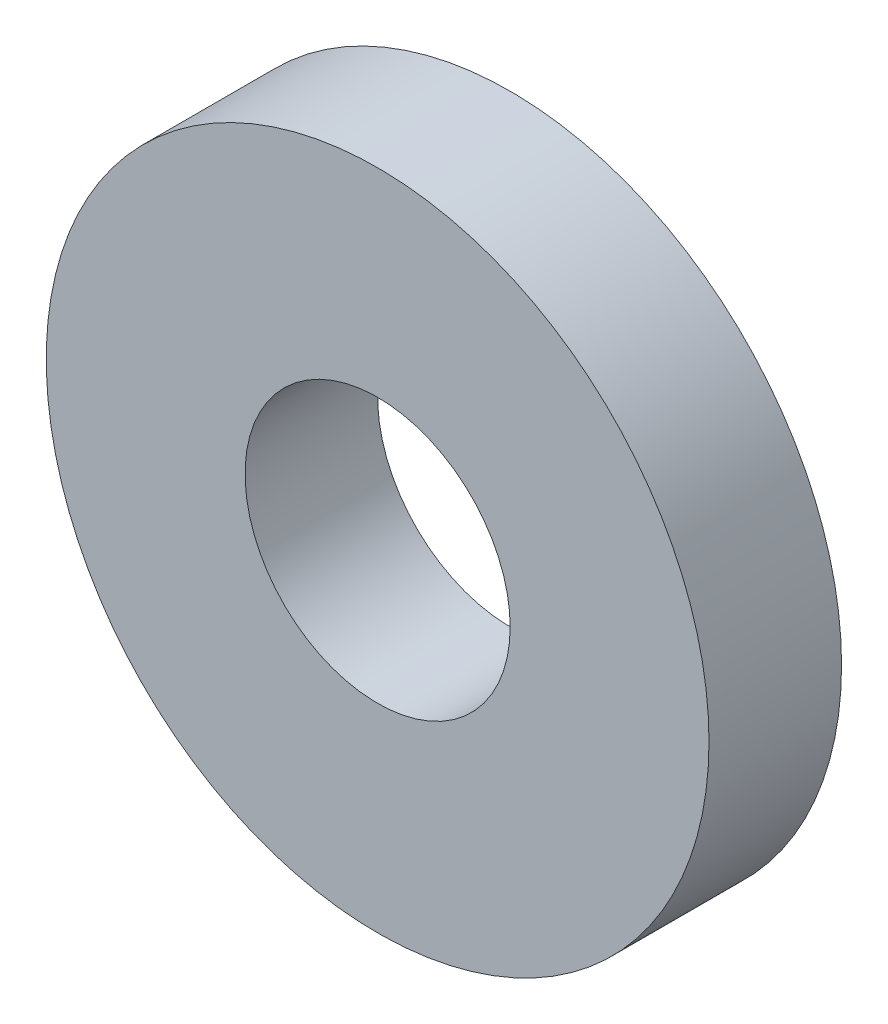
ISO-10303-21;
HEADER;
FILE_DESCRIPTION(('STEP AP214'),'2;1');
FILE_NAME('part.step','',(''),(''),'','','');
FILE_SCHEMA(('AUTOMOTIVE_DESIGN { 1 0 10303 214 1 1 1 1 }'));
ENDSEC;
DATA;
#1=APPLICATION_CONTEXT('core data for automotive mechanical design processes');
#2=APPLICATION_PROTOCOL_DEFINITION('international standard','automotive_design',2000,#1);
#3=PRODUCT_CONTEXT('',#1,'mechanical');
#4=PRODUCT('Part','Part','',(#3));
#5=PRODUCT_RELATED_PRODUCT_CATEGORY('part','',(#4));
#6=PRODUCT_DEFINITION_FORMATION('','',#4);
#7=PRODUCT_DEFINITION_CONTEXT('part definition',#1,'design');
#8=PRODUCT_DEFINITION('design','',#6,#7);
#9=PRODUCT_DEFINITION_SHAPE('','',#8);
#10=(LENGTH_UNIT() NAMED_UNIT(*) SI_UNIT(.MILLI.,.METRE.));
#11=(NAMED_UNIT(*) PLANE_ANGLE_UNIT() SI_UNIT($,.RADIAN.));
#12=(NAMED_UNIT(*) SI_UNIT($,.STERADIAN.) SOLID_ANGLE_UNIT());
#13=UNCERTAINTY_MEASURE_WITH_UNIT(LENGTH_MEASURE(1.E-05),#10,'distance_accuracy_value','');
#14=(GEOMETRIC_REPRESENTATION_CONTEXT(3) GLOBAL_UNCERTAINTY_ASSIGNED_CONTEXT((#13)) GLOBAL_UNIT_ASSIGNED_CONTEXT((#10,
#11,#12)) REPRESENTATION_CONTEXT('',''));
#15=CARTESIAN_POINT('',(0.,0.,0.));
#16=DIRECTION('',(0.,0.,1.));
#17=DIRECTION('',(1.,0.,0.));
#18=AXIS2_PLACEMENT_3D('',#15,#16,#17);
#19=CARTESIAN_POINT('',(0.,0.,2.54));
#20=DIRECTION('',(0.,0.,-1.));
#21=DIRECTION('',(-1.,0.,0.));
#22=AXIS2_PLACEMENT_3D('',#19,#20,#21);
#23=PLANE('',#22);
#24=CARTESIAN_POINT('',(0.,0.,2.54));
#25=DIRECTION('',(0.,0.,1.));
#26=DIRECTION('',(1.,0.,0.));
#27=AXIS2_PLACEMENT_3D('',#24,#25,#26);
#28=CIRCLE('',#27,2.54);
#29=CARTESIAN_POINT('',(2.54,0.,2.54));
#30=VERTEX_POINT('',#29);
#31=EDGE_CURVE('E27',#30,#30,#28,.F.);
#32=ORIENTED_EDGE('',*,*,#31,.T.);
#33=EDGE_LOOP('',(#32));
#34=FACE_BOUND('',#33,.T.);
#35=CARTESIAN_POINT('',(0.,0.,2.54));
#36=DIRECTION('',(0.,0.,1.));
#37=DIRECTION('',(1.,0.,0.));
#38=AXIS2_PLACEMENT_3D('',#35,#36,#37);
#39=CIRCLE('',#38,6.35);
#40=CARTESIAN_POINT('',(6.35,0.,2.54));
#41=VERTEX_POINT('',#40);
#42=EDGE_CURVE('E18',#41,#41,#39,.F.);
#43=ORIENTED_EDGE('',*,*,#42,.F.);
#44=EDGE_LOOP('',(#43));
#45=FACE_BOUND('',#44,.T.);
#46=ADVANCED_FACE('F15',(#34,#45),#23,.F.);
#47=CARTESIAN_POINT('',(0.,0.,0.));
#48=DIRECTION('',(0.,0.,1.));
#49=DIRECTION('',(1.,0.,0.));
#50=AXIS2_PLACEMENT_3D('',#47,#48,#49);
#51=CYLINDRICAL_SURFACE('',#50,6.35);
#52=CARTESIAN_POINT('',(0.,0.,0.));
#53=DIRECTION('',(0.,0.,1.));
#54=DIRECTION('',(1.,0.,0.));
#55=AXIS2_PLACEMENT_3D('',#52,#53,#54);
#56=CIRCLE('',#55,6.35);
#57=CARTESIAN_POINT('',(6.35,0.,0.));
#58=VERTEX_POINT('',#57);
#59=EDGE_CURVE('E22',#58,#58,#56,.F.);
#60=ORIENTED_EDGE('',*,*,#59,.F.);
#61=EDGE_LOOP('',(#60));
#62=FACE_BOUND('',#61,.T.);
#63=ORIENTED_EDGE('',*,*,#42,.T.);
#64=EDGE_LOOP('',(#63));
#65=FACE_BOUND('',#64,.T.);
#66=ADVANCED_FACE('F35',(#62,#65),#51,.T.);
#67=CARTESIAN_POINT('',(0.,0.,0.));
#68=DIRECTION('',(0.,0.,1.));
#69=DIRECTION('',(1.,0.,0.));
#70=AXIS2_PLACEMENT_3D('',#67,#68,#69);
#71=CYLINDRICAL_SURFACE('',#70,2.54);
#72=CARTESIAN_POINT('',(0.,0.,0.));
#73=DIRECTION('',(0.,0.,1.));
#74=DIRECTION('',(1.,0.,0.));
#75=AXIS2_PLACEMENT_3D('',#72,#73,#74);
#76=CIRCLE('',#75,2.54);
#77=CARTESIAN_POINT('',(2.54,0.,0.));
#78=VERTEX_POINT('',#77);
#79=EDGE_CURVE('E10',#78,#78,#76,.T.);
#80=ORIENTED_EDGE('',*,*,#79,.F.);
#81=EDGE_LOOP('',(#80));
#82=FACE_BOUND('',#81,.T.);
#83=ORIENTED_EDGE('',*,*,#31,.F.);
#84=EDGE_LOOP('',(#83));
#85=FACE_BOUND('',#84,.T.);
#86=ADVANCED_FACE('F42',(#82,#85),#71,.F.);
#87=CARTESIAN_POINT('',(0.,0.,0.));
#88=DIRECTION('',(0.,0.,-1.));
#89=DIRECTION('',(-1.,0.,0.));
#90=AXIS2_PLACEMENT_3D('',#87,#88,#89);
#91=PLANE('',#90);
#92=ORIENTED_EDGE('',*,*,#79,.T.);
#93=EDGE_LOOP('',(#92));
#94=FACE_BOUND('',#93,.T.);
#95=ORIENTED_EDGE('',*,*,#59,.T.);
#96=EDGE_LOOP('',(#95));
#97=FACE_BOUND('',#96,.T.);
#98=ADVANCED_FACE('F44',(#94,#97),#91,.T.);
#99=CLOSED_SHELL('',(#46,#66,#86,#98));
#100=MANIFOLD_SOLID_BREP('B1',#99);
#101=ADVANCED_BREP_SHAPE_REPRESENTATION('',(#18,#100),#14);
#102=SHAPE_DEFINITION_REPRESENTATION(#9,#101);
ENDSEC;
END-ISO-10303-21;
